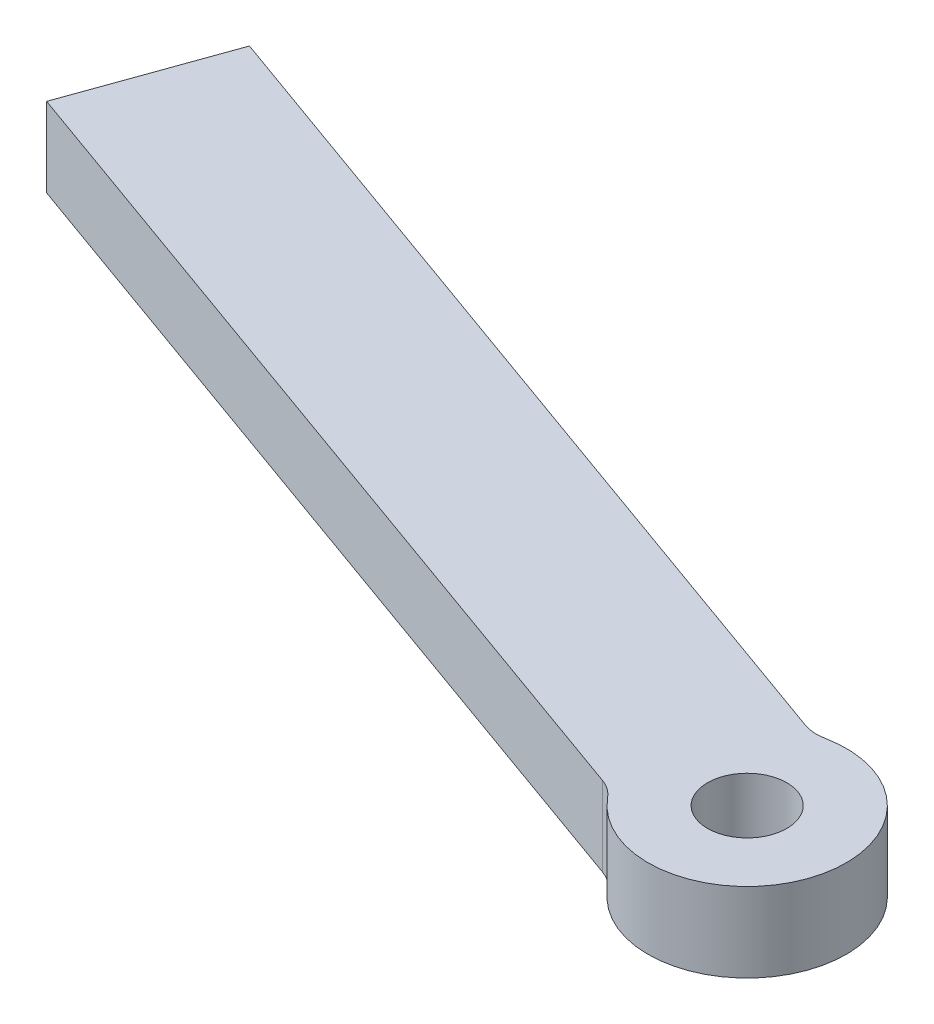
ISO-10303-21;
HEADER;
FILE_DESCRIPTION(('STEP AP214'),'2;1');
FILE_NAME('part.step','',(''),(''),'','','');
FILE_SCHEMA(('AUTOMOTIVE_DESIGN { 1 0 10303 214 1 1 1 1 }'));
ENDSEC;
DATA;
#1=APPLICATION_CONTEXT('core data for automotive mechanical design processes');
#2=APPLICATION_PROTOCOL_DEFINITION('international standard','automotive_design',2000,#1);
#3=PRODUCT_CONTEXT('',#1,'mechanical');
#4=PRODUCT('Part','Part','',(#3));
#5=PRODUCT_RELATED_PRODUCT_CATEGORY('part','',(#4));
#6=PRODUCT_DEFINITION_FORMATION('','',#4);
#7=PRODUCT_DEFINITION_CONTEXT('part definition',#1,'design');
#8=PRODUCT_DEFINITION('design','',#6,#7);
#9=PRODUCT_DEFINITION_SHAPE('','',#8);
#10=(LENGTH_UNIT() NAMED_UNIT(*) SI_UNIT(.MILLI.,.METRE.));
#11=(NAMED_UNIT(*) PLANE_ANGLE_UNIT() SI_UNIT($,.RADIAN.));
#12=(NAMED_UNIT(*) SI_UNIT($,.STERADIAN.) SOLID_ANGLE_UNIT());
#13=UNCERTAINTY_MEASURE_WITH_UNIT(LENGTH_MEASURE(1.E-05),#10,'distance_accuracy_value','');
#14=(GEOMETRIC_REPRESENTATION_CONTEXT(3) GLOBAL_UNCERTAINTY_ASSIGNED_CONTEXT((#13)) GLOBAL_UNIT_ASSIGNED_CONTEXT((#10,
#11,#12)) REPRESENTATION_CONTEXT('',''));
#15=CARTESIAN_POINT('',(0.,0.,0.));
#16=DIRECTION('',(0.,0.,1.));
#17=DIRECTION('',(1.,0.,0.));
#18=AXIS2_PLACEMENT_3D('',#15,#16,#17);
#19=CARTESIAN_POINT('',(-0.674338091003313,2.,1.88288824390138));
#20=DIRECTION('',(-0.337169045501656,0.,0.941444121950688));
#21=DIRECTION('',(0.941444121950688,0.,0.337169045501656));
#22=AXIS2_PLACEMENT_3D('',#19,#20,#21);
#23=PLANE('',#22);
#24=DIRECTION('',(-0.941444121950688,0.,-0.337169045501656));
#25=VECTOR('',#24,1.);
#26=CARTESIAN_POINT('',(-0.674338091003313,0.,1.88288824390138));
#27=LINE('',#26,#25);
#28=CARTESIAN_POINT('',(-2.371550618342,0.,1.27504810287364));
#29=VERTEX_POINT('',#28);
#30=CARTESIAN_POINT('',(-24.2104411397705,0.,-6.54633789364004));
#31=VERTEX_POINT('',#30);
#32=EDGE_CURVE('E134',#29,#31,#27,.T.);
#33=ORIENTED_EDGE('',*,*,#32,.F.);
#34=DIRECTION('',(0.,-1.,0.));
#35=VECTOR('',#34,1.);
#36=CARTESIAN_POINT('',(-2.371550618342,2.,1.27504810287364));
#37=LINE('',#36,#35);
#38=CARTESIAN_POINT('',(-2.371550618342,2.,1.27504810287364));
#39=VERTEX_POINT('',#38);
#40=EDGE_CURVE('E13',#39,#29,#37,.T.);
#41=ORIENTED_EDGE('',*,*,#40,.F.);
#42=DIRECTION('',(-0.941444121950688,0.,-0.337169045501656));
#43=VECTOR('',#42,1.);
#44=CARTESIAN_POINT('',(-0.674338091003313,2.,1.88288824390138));
#45=LINE('',#44,#43);
#46=CARTESIAN_POINT('',(-24.2104411397705,2.,-6.54633789364004));
#47=VERTEX_POINT('',#46);
#48=EDGE_CURVE('E183',#39,#47,#45,.T.);
#49=ORIENTED_EDGE('',*,*,#48,.T.);
#50=DIRECTION('',(0.,-1.,0.));
#51=VECTOR('',#50,1.);
#52=CARTESIAN_POINT('',(-24.2104411397705,2.,-6.54633789364004));
#53=LINE('',#52,#51);
#54=EDGE_CURVE('E91',#47,#31,#53,.T.);
#55=ORIENTED_EDGE('',*,*,#54,.T.);
#56=EDGE_LOOP('',(#33,#41,#49,#55));
#57=FACE_BOUND('',#56,.T.);
#58=ADVANCED_FACE('F45',(#57),#23,.T.);
#59=CARTESIAN_POINT('',(-2.70871966384366,2.,2.21649222482433));
#60=DIRECTION('',(0.,-1.,0.));
#61=DIRECTION('',(0.,0.,-1.));
#62=AXIS2_PLACEMENT_3D('',#59,#60,#61);
#63=CYLINDRICAL_SURFACE('',#62,1.);
#64=CARTESIAN_POINT('',(-2.70871966384366,0.,2.21649222482433));
#65=DIRECTION('',(0.,1.,0.));
#66=DIRECTION('',(0.,0.,1.));
#67=AXIS2_PLACEMENT_3D('',#64,#65,#66);
#68=CIRCLE('',#67,1.);
#69=CARTESIAN_POINT('',(-1.93479975988833,0.,1.58320873201738));
#70=VERTEX_POINT('',#69);
#71=EDGE_CURVE('E136',#29,#70,#68,.F.);
#72=ORIENTED_EDGE('',*,*,#71,.T.);
#73=DIRECTION('',(0.,-1.,0.));
#74=VECTOR('',#73,1.);
#75=CARTESIAN_POINT('',(-1.93479975988833,2.,1.58320873201738));
#76=LINE('',#75,#74);
#77=CARTESIAN_POINT('',(-1.93479975988833,2.,1.58320873201738));
#78=VERTEX_POINT('',#77);
#79=EDGE_CURVE('E54',#78,#70,#76,.T.);
#80=ORIENTED_EDGE('',*,*,#79,.F.);
#81=CARTESIAN_POINT('',(-2.70871966384366,2.,2.21649222482433));
#82=DIRECTION('',(0.,1.,0.));
#83=DIRECTION('',(0.,0.,1.));
#84=AXIS2_PLACEMENT_3D('',#81,#82,#83);
#85=CIRCLE('',#84,1.);
#86=EDGE_CURVE('E126',#39,#78,#85,.F.);
#87=ORIENTED_EDGE('',*,*,#86,.F.);
#88=ORIENTED_EDGE('',*,*,#40,.T.);
#89=EDGE_LOOP('',(#72,#80,#87,#88));
#90=FACE_BOUND('',#89,.T.);
#91=ADVANCED_FACE('F155',(#90),#63,.F.);
#92=CARTESIAN_POINT('',(0.,2.,0.));
#93=DIRECTION('',(0.,-1.,0.));
#94=DIRECTION('',(0.,0.,-1.));
#95=AXIS2_PLACEMENT_3D('',#92,#93,#94);
#96=CYLINDRICAL_SURFACE('',#95,2.5);
#97=CARTESIAN_POINT('',(0.,0.,0.));
#98=DIRECTION('',(0.,1.,0.));
#99=DIRECTION('',(0.,0.,1.));
#100=AXIS2_PLACEMENT_3D('',#97,#98,#99);
#101=CIRCLE('',#100,2.5);
#102=CARTESIAN_POINT('',(-0.489789564881228,0.,-2.45155179062843));
#103=VERTEX_POINT('',#102);
#104=EDGE_CURVE('E139',#70,#103,#101,.T.);
#105=ORIENTED_EDGE('',*,*,#104,.T.);
#106=DIRECTION('',(0.,-1.,0.));
#107=VECTOR('',#106,1.);
#108=CARTESIAN_POINT('',(-0.489789564881228,2.,-2.45155179062843));
#109=LINE('',#108,#107);
#110=CARTESIAN_POINT('',(-0.489789564881228,2.,-2.45155179062843));
#111=VERTEX_POINT('',#110);
#112=EDGE_CURVE('E114',#111,#103,#109,.T.);
#113=ORIENTED_EDGE('',*,*,#112,.F.);
#114=CARTESIAN_POINT('',(0.,2.,0.));
#115=DIRECTION('',(0.,1.,0.));
#116=DIRECTION('',(0.,0.,1.));
#117=AXIS2_PLACEMENT_3D('',#114,#115,#116);
#118=CIRCLE('',#117,2.5);
#119=EDGE_CURVE('E123',#78,#111,#118,.T.);
#120=ORIENTED_EDGE('',*,*,#119,.F.);
#121=ORIENTED_EDGE('',*,*,#79,.T.);
#122=EDGE_LOOP('',(#105,#113,#120,#121));
#123=FACE_BOUND('',#122,.T.);
#124=ADVANCED_FACE('F152',(#123),#96,.T.);
#125=CARTESIAN_POINT('',(-0.685705390833719,2.,-3.4321725068798));
#126=DIRECTION('',(0.,-1.,0.));
#127=DIRECTION('',(0.,0.,-1.));
#128=AXIS2_PLACEMENT_3D('',#125,#126,#127);
#129=CYLINDRICAL_SURFACE('',#128,1.);
#130=CARTESIAN_POINT('',(-0.685705390833719,0.,-3.4321725068798));
#131=DIRECTION('',(0.,1.,0.));
#132=DIRECTION('',(0.,0.,1.));
#133=AXIS2_PLACEMENT_3D('',#130,#131,#132);
#134=CIRCLE('',#133,1.);
#135=CARTESIAN_POINT('',(-1.02287443633538,0.,-2.49072838492911));
#136=VERTEX_POINT('',#135);
#137=EDGE_CURVE('E111',#136,#103,#134,.T.);
#138=ORIENTED_EDGE('',*,*,#137,.F.);
#139=DIRECTION('',(0.,-1.,0.));
#140=VECTOR('',#139,1.);
#141=CARTESIAN_POINT('',(-1.02287443633538,2.,-2.49072838492911));
#142=LINE('',#141,#140);
#143=CARTESIAN_POINT('',(-1.02287443633538,2.,-2.49072838492911));
#144=VERTEX_POINT('',#143);
#145=EDGE_CURVE('E105',#144,#136,#142,.T.);
#146=ORIENTED_EDGE('',*,*,#145,.F.);
#147=CARTESIAN_POINT('',(-0.685705390833719,2.,-3.4321725068798));
#148=DIRECTION('',(0.,1.,0.));
#149=DIRECTION('',(0.,0.,1.));
#150=AXIS2_PLACEMENT_3D('',#147,#148,#149);
#151=CIRCLE('',#150,1.);
#152=EDGE_CURVE('E109',#144,#111,#151,.T.);
#153=ORIENTED_EDGE('',*,*,#152,.T.);
#154=ORIENTED_EDGE('',*,*,#112,.T.);
#155=EDGE_LOOP('',(#138,#146,#153,#154));
#156=FACE_BOUND('',#155,.T.);
#157=ADVANCED_FACE('F107',(#156),#129,.F.);
#158=CARTESIAN_POINT('',(0.674338091003313,2.,-1.88288824390138));
#159=DIRECTION('',(-0.337169045501656,0.,0.941444121950688));
#160=DIRECTION('',(0.941444121950688,0.,0.337169045501656));
#161=AXIS2_PLACEMENT_3D('',#158,#159,#160);
#162=PLANE('',#161);
#163=DIRECTION('',(-0.941444121950688,0.,-0.337169045501656));
#164=VECTOR('',#163,1.);
#165=CARTESIAN_POINT('',(0.674338091003313,0.,-1.88288824390138));
#166=LINE('',#165,#164);
#167=CARTESIAN_POINT('',(-22.8617649577639,0.,-10.3121143814428));
#168=VERTEX_POINT('',#167);
#169=EDGE_CURVE('E143',#136,#168,#166,.T.);
#170=ORIENTED_EDGE('',*,*,#169,.T.);
#171=DIRECTION('',(0.,-1.,0.));
#172=VECTOR('',#171,1.);
#173=CARTESIAN_POINT('',(-22.8617649577639,2.,-10.3121143814428));
#174=LINE('',#173,#172);
#175=CARTESIAN_POINT('',(-22.8617649577639,2.,-10.3121143814428));
#176=VERTEX_POINT('',#175);
#177=EDGE_CURVE('E115',#176,#168,#174,.T.);
#178=ORIENTED_EDGE('',*,*,#177,.F.);
#179=DIRECTION('',(-0.941444121950688,0.,-0.337169045501656));
#180=VECTOR('',#179,1.);
#181=CARTESIAN_POINT('',(0.674338091003313,2.,-1.88288824390138));
#182=LINE('',#181,#180);
#183=EDGE_CURVE('E118',#144,#176,#182,.T.);
#184=ORIENTED_EDGE('',*,*,#183,.F.);
#185=ORIENTED_EDGE('',*,*,#145,.T.);
#186=EDGE_LOOP('',(#170,#178,#184,#185));
#187=FACE_BOUND('',#186,.T.);
#188=ADVANCED_FACE('F119',(#187),#162,.F.);
#189=CARTESIAN_POINT('',(0.,2.,0.));
#190=DIRECTION('',(0.,-1.,0.));
#191=DIRECTION('',(0.,0.,-1.));
#192=AXIS2_PLACEMENT_3D('',#189,#190,#191);
#193=CYLINDRICAL_SURFACE('',#192,1.);
#194=CARTESIAN_POINT('',(0.,2.,0.));
#195=DIRECTION('',(0.,1.,0.));
#196=DIRECTION('',(0.,0.,1.));
#197=AXIS2_PLACEMENT_3D('',#194,#195,#196);
#198=CIRCLE('',#197,1.);
#199=CARTESIAN_POINT('',(0.,2.,1.));
#200=VERTEX_POINT('',#199);
#201=EDGE_CURVE('E146',#200,#200,#198,.T.);
#202=ORIENTED_EDGE('',*,*,#201,.T.);
#203=EDGE_LOOP('',(#202));
#204=FACE_BOUND('',#203,.T.);
#205=CARTESIAN_POINT('',(0.,0.,0.));
#206=DIRECTION('',(0.,1.,0.));
#207=DIRECTION('',(0.,0.,1.));
#208=AXIS2_PLACEMENT_3D('',#205,#206,#207);
#209=CIRCLE('',#208,1.);
#210=CARTESIAN_POINT('',(0.,0.,1.));
#211=VERTEX_POINT('',#210);
#212=EDGE_CURVE('E131',#211,#211,#209,.T.);
#213=ORIENTED_EDGE('',*,*,#212,.F.);
#214=EDGE_LOOP('',(#213));
#215=FACE_BOUND('',#214,.T.);
#216=ADVANCED_FACE('F47',(#204,#215),#193,.F.);
#217=CARTESIAN_POINT('',(-23.5361030487672,2.,-8.42922613754141));
#218=DIRECTION('',(0.941444121950688,0.,0.337169045501656));
#219=DIRECTION('',(0.337169045501656,0.,-0.941444121950688));
#220=AXIS2_PLACEMENT_3D('',#217,#218,#219);
#221=PLANE('',#220);
#222=DIRECTION('',(-0.337169045501656,0.,0.941444121950688));
#223=VECTOR('',#222,1.);
#224=CARTESIAN_POINT('',(-23.5361030487672,0.,-8.42922613754141));
#225=LINE('',#224,#223);
#226=EDGE_CURVE('E84',#168,#31,#225,.T.);
#227=ORIENTED_EDGE('',*,*,#226,.T.);
#228=ORIENTED_EDGE('',*,*,#54,.F.);
#229=DIRECTION('',(-0.337169045501656,0.,0.941444121950688));
#230=VECTOR('',#229,1.);
#231=CARTESIAN_POINT('',(-23.5361030487672,2.,-8.42922613754141));
#232=LINE('',#231,#230);
#233=EDGE_CURVE('E62',#176,#47,#232,.T.);
#234=ORIENTED_EDGE('',*,*,#233,.F.);
#235=ORIENTED_EDGE('',*,*,#177,.T.);
#236=EDGE_LOOP('',(#227,#228,#234,#235));
#237=FACE_BOUND('',#236,.T.);
#238=ADVANCED_FACE('F169',(#237),#221,.F.);
#239=CARTESIAN_POINT('',(0.,2.,0.));
#240=DIRECTION('',(0.,1.,0.));
#241=DIRECTION('',(0.,0.,1.));
#242=AXIS2_PLACEMENT_3D('',#239,#240,#241);
#243=PLANE('',#242);
#244=ORIENTED_EDGE('',*,*,#201,.F.);
#245=EDGE_LOOP('',(#244));
#246=FACE_BOUND('',#245,.T.);
#247=ORIENTED_EDGE('',*,*,#48,.F.);
#248=ORIENTED_EDGE('',*,*,#86,.T.);
#249=ORIENTED_EDGE('',*,*,#119,.T.);
#250=ORIENTED_EDGE('',*,*,#152,.F.);
#251=ORIENTED_EDGE('',*,*,#183,.T.);
#252=ORIENTED_EDGE('',*,*,#233,.T.);
#253=EDGE_LOOP('',(#247,#248,#249,#250,#251,#252));
#254=FACE_BOUND('',#253,.T.);
#255=ADVANCED_FACE('F121',(#246,#254),#243,.T.);
#256=CARTESIAN_POINT('',(0.,0.,0.));
#257=DIRECTION('',(0.,1.,0.));
#258=DIRECTION('',(0.,0.,1.));
#259=AXIS2_PLACEMENT_3D('',#256,#257,#258);
#260=PLANE('',#259);
#261=ORIENTED_EDGE('',*,*,#212,.T.);
#262=EDGE_LOOP('',(#261));
#263=FACE_BOUND('',#262,.T.);
#264=ORIENTED_EDGE('',*,*,#32,.T.);
#265=ORIENTED_EDGE('',*,*,#226,.F.);
#266=ORIENTED_EDGE('',*,*,#169,.F.);
#267=ORIENTED_EDGE('',*,*,#137,.T.);
#268=ORIENTED_EDGE('',*,*,#104,.F.);
#269=ORIENTED_EDGE('',*,*,#71,.F.);
#270=EDGE_LOOP('',(#264,#265,#266,#267,#268,#269));
#271=FACE_BOUND('',#270,.T.);
#272=ADVANCED_FACE('F156',(#263,#271),#260,.F.);
#273=CLOSED_SHELL('',(#58,#91,#124,#157,#188,#216,#238,#255,#272));
#274=MANIFOLD_SOLID_BREP('B2',#273);
#275=ADVANCED_BREP_SHAPE_REPRESENTATION('',(#18,#274),#14);
#276=SHAPE_DEFINITION_REPRESENTATION(#9,#275);
ENDSEC;
END-ISO-10303-21;
